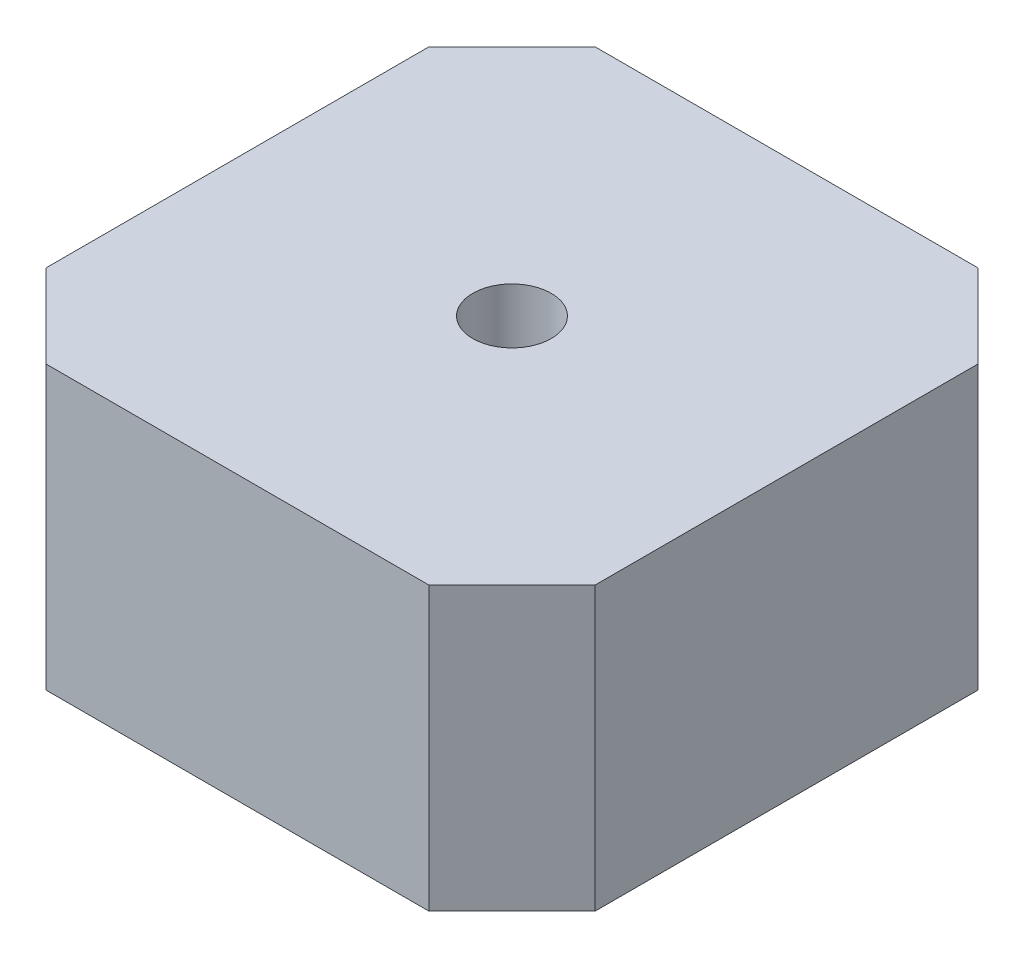
ISO-10303-21;
HEADER;
FILE_DESCRIPTION(('STEP AP214'),'2;1');
FILE_NAME('part.step','',(''),(''),'','','');
FILE_SCHEMA(('AUTOMOTIVE_DESIGN { 1 0 10303 214 1 1 1 1 }'));
ENDSEC;
DATA;
#1=APPLICATION_CONTEXT('core data for automotive mechanical design processes');
#2=APPLICATION_PROTOCOL_DEFINITION('international standard','automotive_design',2000,#1);
#3=PRODUCT_CONTEXT('',#1,'mechanical');
#4=PRODUCT('Part','Part','',(#3));
#5=PRODUCT_RELATED_PRODUCT_CATEGORY('part','',(#4));
#6=PRODUCT_DEFINITION_FORMATION('','',#4);
#7=PRODUCT_DEFINITION_CONTEXT('part definition',#1,'design');
#8=PRODUCT_DEFINITION('design','',#6,#7);
#9=PRODUCT_DEFINITION_SHAPE('','',#8);
#10=(LENGTH_UNIT() NAMED_UNIT(*) SI_UNIT(.MILLI.,.METRE.));
#11=(NAMED_UNIT(*) PLANE_ANGLE_UNIT() SI_UNIT($,.RADIAN.));
#12=(NAMED_UNIT(*) SI_UNIT($,.STERADIAN.) SOLID_ANGLE_UNIT());
#13=UNCERTAINTY_MEASURE_WITH_UNIT(LENGTH_MEASURE(1.E-05),#10,'distance_accuracy_value','');
#14=(GEOMETRIC_REPRESENTATION_CONTEXT(3) GLOBAL_UNCERTAINTY_ASSIGNED_CONTEXT((#13)) GLOBAL_UNIT_ASSIGNED_CONTEXT((#10,
#11,#12)) REPRESENTATION_CONTEXT('',''));
#15=CARTESIAN_POINT('',(0.,0.,0.));
#16=DIRECTION('',(0.,0.,1.));
#17=DIRECTION('',(1.,0.,0.));
#18=AXIS2_PLACEMENT_3D('',#15,#16,#17);
#19=CARTESIAN_POINT('',(0.,18.,0.));
#20=DIRECTION('',(1.,0.,0.));
#21=DIRECTION('',(0.,0.,-1.));
#22=AXIS2_PLACEMENT_3D('',#19,#20,#21);
#23=PLANE('',#22);
#24=DIRECTION('',(0.,1.,0.));
#25=VECTOR('',#24,1.);
#26=CARTESIAN_POINT('',(0.,0.,-5.30151519016501));
#27=LINE('',#26,#25);
#28=CARTESIAN_POINT('',(0.,0.,-5.30151519016501));
#29=VERTEX_POINT('',#28);
#30=CARTESIAN_POINT('',(0.,18.,-5.30151519016501));
#31=VERTEX_POINT('',#30);
#32=EDGE_CURVE('E104',#29,#31,#27,.T.);
#33=ORIENTED_EDGE('',*,*,#32,.T.);
#34=DIRECTION('',(0.,0.,1.));
#35=VECTOR('',#34,1.);
#36=CARTESIAN_POINT('',(0.,18.,0.));
#37=LINE('',#36,#35);
#38=CARTESIAN_POINT('',(0.,18.,-29.698484809835));
#39=VERTEX_POINT('',#38);
#40=EDGE_CURVE('E133',#39,#31,#37,.T.);
#41=ORIENTED_EDGE('',*,*,#40,.F.);
#42=DIRECTION('',(0.,1.,0.));
#43=VECTOR('',#42,1.);
#44=CARTESIAN_POINT('',(0.,0.,-29.698484809835));
#45=LINE('',#44,#43);
#46=CARTESIAN_POINT('',(0.,0.,-29.698484809835));
#47=VERTEX_POINT('',#46);
#48=EDGE_CURVE('E139',#47,#39,#45,.T.);
#49=ORIENTED_EDGE('',*,*,#48,.F.);
#50=DIRECTION('',(0.,0.,1.));
#51=VECTOR('',#50,1.);
#52=CARTESIAN_POINT('',(0.,0.,0.));
#53=LINE('',#52,#51);
#54=EDGE_CURVE('E124',#47,#29,#53,.T.);
#55=ORIENTED_EDGE('',*,*,#54,.T.);
#56=EDGE_LOOP('',(#33,#41,#49,#55));
#57=FACE_BOUND('',#56,.T.);
#58=ADVANCED_FACE('F33',(#57),#23,.F.);
#59=CARTESIAN_POINT('',(0.,18.,0.));
#60=DIRECTION('',(0.,0.,-1.));
#61=DIRECTION('',(-1.,0.,0.));
#62=AXIS2_PLACEMENT_3D('',#59,#60,#61);
#63=PLANE('',#62);
#64=DIRECTION('',(0.,1.,0.));
#65=VECTOR('',#64,1.);
#66=CARTESIAN_POINT('',(29.698484809835,0.,0.));
#67=LINE('',#66,#65);
#68=CARTESIAN_POINT('',(29.698484809835,0.,0.));
#69=VERTEX_POINT('',#68);
#70=CARTESIAN_POINT('',(29.698484809835,18.,0.));
#71=VERTEX_POINT('',#70);
#72=EDGE_CURVE('E49',#69,#71,#67,.T.);
#73=ORIENTED_EDGE('',*,*,#72,.T.);
#74=DIRECTION('',(1.,0.,0.));
#75=VECTOR('',#74,1.);
#76=CARTESIAN_POINT('',(0.,18.,0.));
#77=LINE('',#76,#75);
#78=CARTESIAN_POINT('',(5.30151519016499,18.,0.));
#79=VERTEX_POINT('',#78);
#80=EDGE_CURVE('E118',#79,#71,#77,.T.);
#81=ORIENTED_EDGE('',*,*,#80,.F.);
#82=DIRECTION('',(0.,1.,0.));
#83=VECTOR('',#82,1.);
#84=CARTESIAN_POINT('',(5.30151519016499,0.,0.));
#85=LINE('',#84,#83);
#86=CARTESIAN_POINT('',(5.30151519016499,0.,0.));
#87=VERTEX_POINT('',#86);
#88=EDGE_CURVE('E101',#87,#79,#85,.T.);
#89=ORIENTED_EDGE('',*,*,#88,.F.);
#90=DIRECTION('',(1.,0.,0.));
#91=VECTOR('',#90,1.);
#92=CARTESIAN_POINT('',(0.,0.,0.));
#93=LINE('',#92,#91);
#94=EDGE_CURVE('E116',#87,#69,#93,.T.);
#95=ORIENTED_EDGE('',*,*,#94,.T.);
#96=EDGE_LOOP('',(#73,#81,#89,#95));
#97=FACE_BOUND('',#96,.T.);
#98=ADVANCED_FACE('F115',(#97),#63,.F.);
#99=CARTESIAN_POINT('',(35.,18.,0.));
#100=DIRECTION('',(-1.,0.,0.));
#101=DIRECTION('',(0.,0.,1.));
#102=AXIS2_PLACEMENT_3D('',#99,#100,#101);
#103=PLANE('',#102);
#104=DIRECTION('',(0.,1.,0.));
#105=VECTOR('',#104,1.);
#106=CARTESIAN_POINT('',(35.,0.,-29.698484809835));
#107=LINE('',#106,#105);
#108=CARTESIAN_POINT('',(35.,0.,-29.698484809835));
#109=VERTEX_POINT('',#108);
#110=CARTESIAN_POINT('',(35.,18.,-29.698484809835));
#111=VERTEX_POINT('',#110);
#112=EDGE_CURVE('E57',#109,#111,#107,.T.);
#113=ORIENTED_EDGE('',*,*,#112,.T.);
#114=DIRECTION('',(0.,0.,-1.));
#115=VECTOR('',#114,1.);
#116=CARTESIAN_POINT('',(35.,18.,0.));
#117=LINE('',#116,#115);
#118=CARTESIAN_POINT('',(35.,18.,-5.30151519016499));
#119=VERTEX_POINT('',#118);
#120=EDGE_CURVE('E41',#119,#111,#117,.T.);
#121=ORIENTED_EDGE('',*,*,#120,.F.);
#122=DIRECTION('',(0.,1.,0.));
#123=VECTOR('',#122,1.);
#124=CARTESIAN_POINT('',(35.,0.,-5.30151519016499));
#125=LINE('',#124,#123);
#126=CARTESIAN_POINT('',(35.,0.,-5.30151519016499));
#127=VERTEX_POINT('',#126);
#128=EDGE_CURVE('E144',#127,#119,#125,.T.);
#129=ORIENTED_EDGE('',*,*,#128,.F.);
#130=DIRECTION('',(0.,0.,-1.));
#131=VECTOR('',#130,1.);
#132=CARTESIAN_POINT('',(35.,0.,0.));
#133=LINE('',#132,#131);
#134=EDGE_CURVE('E123',#127,#109,#133,.T.);
#135=ORIENTED_EDGE('',*,*,#134,.T.);
#136=EDGE_LOOP('',(#113,#121,#129,#135));
#137=FACE_BOUND('',#136,.T.);
#138=ADVANCED_FACE('F195',(#137),#103,.F.);
#139=CARTESIAN_POINT('',(0.,18.,-35.));
#140=DIRECTION('',(0.,0.,1.));
#141=DIRECTION('',(1.,0.,0.));
#142=AXIS2_PLACEMENT_3D('',#139,#140,#141);
#143=PLANE('',#142);
#144=DIRECTION('',(0.,1.,0.));
#145=VECTOR('',#144,1.);
#146=CARTESIAN_POINT('',(29.698484809835,0.,-35.));
#147=LINE('',#146,#145);
#148=CARTESIAN_POINT('',(29.698484809835,0.,-35.));
#149=VERTEX_POINT('',#148);
#150=CARTESIAN_POINT('',(29.698484809835,18.,-35.));
#151=VERTEX_POINT('',#150);
#152=EDGE_CURVE('E127',#149,#151,#147,.T.);
#153=ORIENTED_EDGE('',*,*,#152,.F.);
#154=DIRECTION('',(-1.,0.,0.));
#155=VECTOR('',#154,1.);
#156=CARTESIAN_POINT('',(0.,0.,-35.));
#157=LINE('',#156,#155);
#158=CARTESIAN_POINT('',(5.30151519016502,0.,-35.));
#159=VERTEX_POINT('',#158);
#160=EDGE_CURVE('E36',#149,#159,#157,.T.);
#161=ORIENTED_EDGE('',*,*,#160,.T.);
#162=DIRECTION('',(0.,1.,0.));
#163=VECTOR('',#162,1.);
#164=CARTESIAN_POINT('',(5.30151519016501,0.,-35.));
#165=LINE('',#164,#163);
#166=CARTESIAN_POINT('',(5.30151519016501,18.,-35.));
#167=VERTEX_POINT('',#166);
#168=EDGE_CURVE('E136',#159,#167,#165,.T.);
#169=ORIENTED_EDGE('',*,*,#168,.T.);
#170=DIRECTION('',(-1.,0.,0.));
#171=VECTOR('',#170,1.);
#172=CARTESIAN_POINT('',(0.,18.,-35.));
#173=LINE('',#172,#171);
#174=EDGE_CURVE('E12',#151,#167,#173,.T.);
#175=ORIENTED_EDGE('',*,*,#174,.F.);
#176=EDGE_LOOP('',(#153,#161,#169,#175));
#177=FACE_BOUND('',#176,.T.);
#178=ADVANCED_FACE('F180',(#177),#143,.F.);
#179=CARTESIAN_POINT('',(0.,18.,0.));
#180=DIRECTION('',(0.,-1.,0.));
#181=DIRECTION('',(0.,0.,-1.));
#182=AXIS2_PLACEMENT_3D('',#179,#180,#181);
#183=PLANE('',#182);
#184=CARTESIAN_POINT('',(17.5,18.,-17.5));
#185=DIRECTION('',(0.,1.,0.));
#186=DIRECTION('',(0.,0.,1.));
#187=AXIS2_PLACEMENT_3D('',#184,#185,#186);
#188=CIRCLE('',#187,2.5);
#189=CARTESIAN_POINT('',(17.5,18.,-15.));
#190=VERTEX_POINT('',#189);
#191=EDGE_CURVE('E163',#190,#190,#188,.T.);
#192=ORIENTED_EDGE('',*,*,#191,.F.);
#193=EDGE_LOOP('',(#192));
#194=FACE_BOUND('',#193,.T.);
#195=DIRECTION('',(-0.707106781186546,0.,-0.707106781186549));
#196=VECTOR('',#195,1.);
#197=CARTESIAN_POINT('',(35.,18.,-29.698484809835));
#198=LINE('',#197,#196);
#199=EDGE_CURVE('E148',#111,#151,#198,.T.);
#200=ORIENTED_EDGE('',*,*,#199,.T.);
#201=ORIENTED_EDGE('',*,*,#174,.T.);
#202=DIRECTION('',(-0.707106781186549,0.,0.707106781186546));
#203=VECTOR('',#202,1.);
#204=CARTESIAN_POINT('',(5.30151519016501,18.,-35.));
#205=LINE('',#204,#203);
#206=EDGE_CURVE('E156',#167,#39,#205,.T.);
#207=ORIENTED_EDGE('',*,*,#206,.T.);
#208=ORIENTED_EDGE('',*,*,#40,.T.);
#209=DIRECTION('',(0.707106781186546,0.,0.707106781186549));
#210=VECTOR('',#209,1.);
#211=CARTESIAN_POINT('',(0.,18.,-5.30151519016501));
#212=LINE('',#211,#210);
#213=EDGE_CURVE('E154',#31,#79,#212,.T.);
#214=ORIENTED_EDGE('',*,*,#213,.T.);
#215=ORIENTED_EDGE('',*,*,#80,.T.);
#216=DIRECTION('',(0.707106781186549,0.,-0.707106781186546));
#217=VECTOR('',#216,1.);
#218=CARTESIAN_POINT('',(29.698484809835,18.,0.));
#219=LINE('',#218,#217);
#220=EDGE_CURVE('E151',#71,#119,#219,.T.);
#221=ORIENTED_EDGE('',*,*,#220,.T.);
#222=ORIENTED_EDGE('',*,*,#120,.T.);
#223=EDGE_LOOP('',(#200,#201,#207,#208,#214,#215,#221,#222));
#224=FACE_BOUND('',#223,.T.);
#225=ADVANCED_FACE('F177',(#194,#224),#183,.F.);
#226=CARTESIAN_POINT('',(0.,0.,0.));
#227=DIRECTION('',(0.,-1.,0.));
#228=DIRECTION('',(0.,0.,-1.));
#229=AXIS2_PLACEMENT_3D('',#226,#227,#228);
#230=PLANE('',#229);
#231=CARTESIAN_POINT('',(17.5,0.,-17.5));
#232=DIRECTION('',(0.,1.,0.));
#233=DIRECTION('',(0.,0.,1.));
#234=AXIS2_PLACEMENT_3D('',#231,#232,#233);
#235=CIRCLE('',#234,2.5);
#236=CARTESIAN_POINT('',(17.5,0.,-15.));
#237=VERTEX_POINT('',#236);
#238=EDGE_CURVE('E159',#237,#237,#235,.T.);
#239=ORIENTED_EDGE('',*,*,#238,.T.);
#240=EDGE_LOOP('',(#239));
#241=FACE_BOUND('',#240,.T.);
#242=ORIENTED_EDGE('',*,*,#160,.F.);
#243=DIRECTION('',(-0.707106781186546,0.,-0.707106781186549));
#244=VECTOR('',#243,1.);
#245=CARTESIAN_POINT('',(35.,0.,-29.698484809835));
#246=LINE('',#245,#244);
#247=EDGE_CURVE('E140',#109,#149,#246,.T.);
#248=ORIENTED_EDGE('',*,*,#247,.F.);
#249=ORIENTED_EDGE('',*,*,#134,.F.);
#250=DIRECTION('',(0.707106781186549,0.,-0.707106781186546));
#251=VECTOR('',#250,1.);
#252=CARTESIAN_POINT('',(29.698484809835,0.,0.));
#253=LINE('',#252,#251);
#254=EDGE_CURVE('E109',#69,#127,#253,.T.);
#255=ORIENTED_EDGE('',*,*,#254,.F.);
#256=ORIENTED_EDGE('',*,*,#94,.F.);
#257=DIRECTION('',(0.707106781186546,0.,0.707106781186549));
#258=VECTOR('',#257,1.);
#259=CARTESIAN_POINT('',(0.,0.,-5.30151519016501));
#260=LINE('',#259,#258);
#261=EDGE_CURVE('E98',#29,#87,#260,.T.);
#262=ORIENTED_EDGE('',*,*,#261,.F.);
#263=ORIENTED_EDGE('',*,*,#54,.F.);
#264=DIRECTION('',(-0.707106781186549,0.,0.707106781186546));
#265=VECTOR('',#264,1.);
#266=CARTESIAN_POINT('',(5.30151519016501,0.,-35.));
#267=LINE('',#266,#265);
#268=EDGE_CURVE('E110',#159,#47,#267,.T.);
#269=ORIENTED_EDGE('',*,*,#268,.F.);
#270=EDGE_LOOP('',(#242,#248,#249,#255,#256,#262,#263,#269));
#271=FACE_BOUND('',#270,.T.);
#272=ADVANCED_FACE('F121',(#241,#271),#230,.T.);
#273=CARTESIAN_POINT('',(5.30151519016501,0.,-35.));
#274=DIRECTION('',(-0.707106781186546,0.,-0.707106781186549));
#275=DIRECTION('',(-0.707106781186549,0.,0.707106781186546));
#276=AXIS2_PLACEMENT_3D('',#273,#274,#275);
#277=PLANE('',#276);
#278=ORIENTED_EDGE('',*,*,#206,.F.);
#279=ORIENTED_EDGE('',*,*,#168,.F.);
#280=ORIENTED_EDGE('',*,*,#268,.T.);
#281=ORIENTED_EDGE('',*,*,#48,.T.);
#282=EDGE_LOOP('',(#278,#279,#280,#281));
#283=FACE_BOUND('',#282,.T.);
#284=ADVANCED_FACE('F189',(#283),#277,.T.);
#285=CARTESIAN_POINT('',(0.,0.,-5.30151519016501));
#286=DIRECTION('',(-0.707106781186549,0.,0.707106781186546));
#287=DIRECTION('',(0.707106781186546,0.,0.707106781186549));
#288=AXIS2_PLACEMENT_3D('',#285,#286,#287);
#289=PLANE('',#288);
#290=ORIENTED_EDGE('',*,*,#213,.F.);
#291=ORIENTED_EDGE('',*,*,#32,.F.);
#292=ORIENTED_EDGE('',*,*,#261,.T.);
#293=ORIENTED_EDGE('',*,*,#88,.T.);
#294=EDGE_LOOP('',(#290,#291,#292,#293));
#295=FACE_BOUND('',#294,.T.);
#296=ADVANCED_FACE('F100',(#295),#289,.T.);
#297=CARTESIAN_POINT('',(29.698484809835,0.,0.));
#298=DIRECTION('',(0.707106781186546,0.,0.707106781186549));
#299=DIRECTION('',(0.707106781186549,0.,-0.707106781186546));
#300=AXIS2_PLACEMENT_3D('',#297,#298,#299);
#301=PLANE('',#300);
#302=ORIENTED_EDGE('',*,*,#220,.F.);
#303=ORIENTED_EDGE('',*,*,#72,.F.);
#304=ORIENTED_EDGE('',*,*,#254,.T.);
#305=ORIENTED_EDGE('',*,*,#128,.T.);
#306=EDGE_LOOP('',(#302,#303,#304,#305));
#307=FACE_BOUND('',#306,.T.);
#308=ADVANCED_FACE('F197',(#307),#301,.T.);
#309=CARTESIAN_POINT('',(35.,0.,-29.698484809835));
#310=DIRECTION('',(0.707106781186549,0.,-0.707106781186546));
#311=DIRECTION('',(-0.707106781186546,0.,-0.707106781186549));
#312=AXIS2_PLACEMENT_3D('',#309,#310,#311);
#313=PLANE('',#312);
#314=ORIENTED_EDGE('',*,*,#199,.F.);
#315=ORIENTED_EDGE('',*,*,#112,.F.);
#316=ORIENTED_EDGE('',*,*,#247,.T.);
#317=ORIENTED_EDGE('',*,*,#152,.T.);
#318=EDGE_LOOP('',(#314,#315,#316,#317));
#319=FACE_BOUND('',#318,.T.);
#320=ADVANCED_FACE('F173',(#319),#313,.T.);
#321=CARTESIAN_POINT('',(17.5,0.,-17.5));
#322=DIRECTION('',(0.,1.,0.));
#323=DIRECTION('',(0.,0.,1.));
#324=AXIS2_PLACEMENT_3D('',#321,#322,#323);
#325=CYLINDRICAL_SURFACE('',#324,2.5);
#326=ORIENTED_EDGE('',*,*,#238,.F.);
#327=EDGE_LOOP('',(#326));
#328=FACE_BOUND('',#327,.T.);
#329=ORIENTED_EDGE('',*,*,#191,.T.);
#330=EDGE_LOOP('',(#329));
#331=FACE_BOUND('',#330,.T.);
#332=ADVANCED_FACE('F170',(#328,#331),#325,.F.);
#333=CLOSED_SHELL('',(#58,#98,#138,#178,#225,#272,#284,#296,#308,#320,#332));
#334=MANIFOLD_SOLID_BREP('B2',#333);
#335=ADVANCED_BREP_SHAPE_REPRESENTATION('',(#18,#334),#14);
#336=SHAPE_DEFINITION_REPRESENTATION(#9,#335);
ENDSEC;
END-ISO-10303-21;
